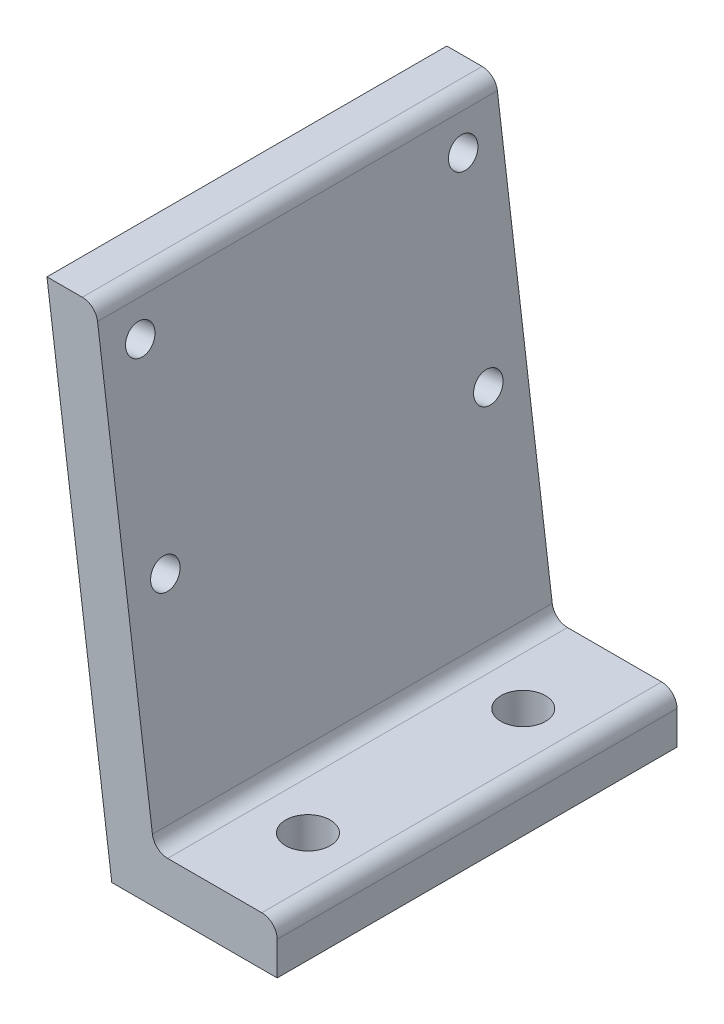
ISO-10303-21;
HEADER;
FILE_DESCRIPTION(('STEP AP214'),'2;1');
FILE_NAME('part.step','',(''),(''),'','','');
FILE_SCHEMA(('AUTOMOTIVE_DESIGN { 1 0 10303 214 1 1 1 1 }'));
ENDSEC;
DATA;
#1=APPLICATION_CONTEXT('core data for automotive mechanical design processes');
#2=APPLICATION_PROTOCOL_DEFINITION('international standard','automotive_design',2000,#1);
#3=PRODUCT_CONTEXT('',#1,'mechanical');
#4=PRODUCT('Part','Part','',(#3));
#5=PRODUCT_RELATED_PRODUCT_CATEGORY('part','',(#4));
#6=PRODUCT_DEFINITION_FORMATION('','',#4);
#7=PRODUCT_DEFINITION_CONTEXT('part definition',#1,'design');
#8=PRODUCT_DEFINITION('design','',#6,#7);
#9=PRODUCT_DEFINITION_SHAPE('','',#8);
#10=(LENGTH_UNIT() NAMED_UNIT(*) SI_UNIT(.MILLI.,.METRE.));
#11=(NAMED_UNIT(*) PLANE_ANGLE_UNIT() SI_UNIT($,.RADIAN.));
#12=(NAMED_UNIT(*) SI_UNIT($,.STERADIAN.) SOLID_ANGLE_UNIT());
#13=UNCERTAINTY_MEASURE_WITH_UNIT(LENGTH_MEASURE(1.E-05),#10,'distance_accuracy_value','');
#14=(GEOMETRIC_REPRESENTATION_CONTEXT(3) GLOBAL_UNCERTAINTY_ASSIGNED_CONTEXT((#13)) GLOBAL_UNIT_ASSIGNED_CONTEXT((#10,
#11,#12)) REPRESENTATION_CONTEXT('',''));
#15=CARTESIAN_POINT('',(0.,0.,0.));
#16=DIRECTION('',(0.,0.,1.));
#17=DIRECTION('',(1.,0.,0.));
#18=AXIS2_PLACEMENT_3D('',#15,#16,#17);
#19=CARTESIAN_POINT('',(-3.79488324295659,28.825,26.));
#20=DIRECTION('',(-0.991444861373811,-0.130526192220048,0.));
#21=DIRECTION('',(0.130526192220048,-0.991444861373811,0.));
#22=AXIS2_PLACEMENT_3D('',#19,#20,#21);
#23=PLANE('',#22);
#24=CARTESIAN_POINT('',(-1.77172726354584,13.4576046487059,23.5));
#25=DIRECTION('',(0.991444861373811,0.130526192220048,0.));
#26=DIRECTION('',(-0.130526192220048,0.991444861373811,0.));
#27=AXIS2_PLACEMENT_3D('',#24,#25,#26);
#28=CIRCLE('',#27,0.950000000000001);
#29=CARTESIAN_POINT('',(-1.89572714615489,14.3994772670111,23.5));
#30=VERTEX_POINT('',#29);
#31=EDGE_CURVE('E203',#30,#30,#28,.T.);
#32=ORIENTED_EDGE('',*,*,#31,.F.);
#33=EDGE_LOOP('',(#32));
#34=FACE_BOUND('',#33,.T.);
#35=CARTESIAN_POINT('',(-1.77172726354584,13.4576046487059,2.5));
#36=DIRECTION('',(0.991444861373811,0.130526192220048,0.));
#37=DIRECTION('',(-0.130526192220048,0.991444861373811,0.));
#38=AXIS2_PLACEMENT_3D('',#35,#36,#37);
#39=CIRCLE('',#38,0.95);
#40=CARTESIAN_POINT('',(-1.89572714615489,14.3994772670111,2.5));
#41=VERTEX_POINT('',#40);
#42=EDGE_CURVE('E202',#41,#41,#39,.T.);
#43=ORIENTED_EDGE('',*,*,#42,.F.);
#44=EDGE_LOOP('',(#43));
#45=FACE_BOUND('',#44,.T.);
#46=CARTESIAN_POINT('',(-3.40330466629645,25.8506654158786,2.50000000000001));
#47=DIRECTION('',(0.991444861373811,0.130526192220048,0.));
#48=DIRECTION('',(-0.130526192220048,0.991444861373811,0.));
#49=AXIS2_PLACEMENT_3D('',#46,#47,#48);
#50=CIRCLE('',#49,0.95);
#51=CARTESIAN_POINT('',(-3.52730454890549,26.7925380341837,2.50000000000001));
#52=VERTEX_POINT('',#51);
#53=EDGE_CURVE('E210',#52,#52,#50,.T.);
#54=ORIENTED_EDGE('',*,*,#53,.F.);
#55=EDGE_LOOP('',(#54));
#56=FACE_BOUND('',#55,.T.);
#57=CARTESIAN_POINT('',(-3.40330466629645,25.8506654158786,23.5));
#58=DIRECTION('',(0.991444861373811,0.130526192220048,0.));
#59=DIRECTION('',(-0.130526192220048,0.991444861373811,0.));
#60=AXIS2_PLACEMENT_3D('',#57,#58,#59);
#61=CIRCLE('',#60,0.950000000000001);
#62=CARTESIAN_POINT('',(-3.52730454890549,26.7925380341837,23.5));
#63=VERTEX_POINT('',#62);
#64=EDGE_CURVE('E195',#63,#63,#61,.T.);
#65=ORIENTED_EDGE('',*,*,#64,.F.);
#66=EDGE_LOOP('',(#65));
#67=FACE_BOUND('',#66,.T.);
#68=DIRECTION('',(-0.130526192220048,0.991444861373811,0.));
#69=VECTOR('',#68,1.);
#70=CARTESIAN_POINT('',(-3.79488324295659,28.825,26.));
#71=LINE('',#70,#69);
#72=CARTESIAN_POINT('',(-0.114468398381051,0.869473807779953,26.));
#73=VERTEX_POINT('',#72);
#74=CARTESIAN_POINT('',(-3.68041484457554,27.95552619222,26.));
#75=VERTEX_POINT('',#74);
#76=EDGE_CURVE('E114',#73,#75,#71,.T.);
#77=ORIENTED_EDGE('',*,*,#76,.F.);
#78=DIRECTION('',(0.,0.,-1.));
#79=VECTOR('',#78,1.);
#80=CARTESIAN_POINT('',(-0.114468398381051,0.869473807779952,0.));
#81=LINE('',#80,#79);
#82=CARTESIAN_POINT('',(-0.114468398381051,0.869473807779953,0.));
#83=VERTEX_POINT('',#82);
#84=EDGE_CURVE('E162',#73,#83,#81,.T.);
#85=ORIENTED_EDGE('',*,*,#84,.T.);
#86=DIRECTION('',(-0.130526192220048,0.991444861373811,0.));
#87=VECTOR('',#86,1.);
#88=CARTESIAN_POINT('',(-3.79488324295659,28.825,0.));
#89=LINE('',#88,#87);
#90=CARTESIAN_POINT('',(-3.68041484457554,27.95552619222,0.));
#91=VERTEX_POINT('',#90);
#92=EDGE_CURVE('E139',#83,#91,#89,.T.);
#93=ORIENTED_EDGE('',*,*,#92,.T.);
#94=DIRECTION('',(0.,0.,-1.));
#95=VECTOR('',#94,1.);
#96=CARTESIAN_POINT('',(-3.68041484457554,27.95552619222,26.));
#97=LINE('',#96,#95);
#98=EDGE_CURVE('E158',#91,#75,#97,.F.);
#99=ORIENTED_EDGE('',*,*,#98,.T.);
#100=EDGE_LOOP('',(#77,#85,#93,#99));
#101=FACE_BOUND('',#100,.T.);
#102=ADVANCED_FACE('F33',(#34,#45,#56,#67,#101),#23,.F.);
#103=CARTESIAN_POINT('',(-6.96988324295659,28.825,26.));
#104=DIRECTION('',(0.,-1.,0.));
#105=DIRECTION('',(0.,0.,-1.));
#106=AXIS2_PLACEMENT_3D('',#103,#104,#105);
#107=PLANE('',#106);
#108=DIRECTION('',(-1.,0.,0.));
#109=VECTOR('',#108,1.);
#110=CARTESIAN_POINT('',(-6.96988324295659,28.825,26.));
#111=LINE('',#110,#109);
#112=CARTESIAN_POINT('',(-4.67185970594935,28.825,26.));
#113=VERTEX_POINT('',#112);
#114=CARTESIAN_POINT('',(-6.96988324295659,28.825,26.));
#115=VERTEX_POINT('',#114);
#116=EDGE_CURVE('E103',#113,#115,#111,.T.);
#117=ORIENTED_EDGE('',*,*,#116,.F.);
#118=DIRECTION('',(0.,0.,-1.));
#119=VECTOR('',#118,1.);
#120=CARTESIAN_POINT('',(-4.67185970594935,28.825,26.));
#121=LINE('',#120,#119);
#122=CARTESIAN_POINT('',(-4.67185970594935,28.825,0.));
#123=VERTEX_POINT('',#122);
#124=EDGE_CURVE('E123',#113,#123,#121,.T.);
#125=ORIENTED_EDGE('',*,*,#124,.T.);
#126=DIRECTION('',(-1.,0.,0.));
#127=VECTOR('',#126,1.);
#128=CARTESIAN_POINT('',(-6.96988324295659,28.825,0.));
#129=LINE('',#128,#127);
#130=CARTESIAN_POINT('',(-6.96988324295659,28.825,0.));
#131=VERTEX_POINT('',#130);
#132=EDGE_CURVE('E120',#123,#131,#129,.T.);
#133=ORIENTED_EDGE('',*,*,#132,.T.);
#134=DIRECTION('',(0.,0.,-1.));
#135=VECTOR('',#134,1.);
#136=CARTESIAN_POINT('',(-6.96988324295659,28.825,26.));
#137=LINE('',#136,#135);
#138=EDGE_CURVE('E117',#115,#131,#137,.T.);
#139=ORIENTED_EDGE('',*,*,#138,.F.);
#140=EDGE_LOOP('',(#117,#125,#133,#139));
#141=FACE_BOUND('',#140,.T.);
#142=ADVANCED_FACE('F118',(#141),#107,.F.);
#143=CARTESIAN_POINT('',(-2.75700332016003,-3.175,26.));
#144=DIRECTION('',(0.991444861373811,0.130526192220048,0.));
#145=DIRECTION('',(-0.130526192220048,0.991444861373811,0.));
#146=AXIS2_PLACEMENT_3D('',#143,#144,#145);
#147=PLANE('',#146);
#148=CARTESIAN_POINT('',(-4.89263451277974,13.0467294146057,23.5));
#149=DIRECTION('',(0.991444861373811,0.130526192220048,0.));
#150=DIRECTION('',(-0.130526192220048,0.991444861373811,0.));
#151=AXIS2_PLACEMENT_3D('',#148,#149,#150);
#152=CIRCLE('',#151,0.950000000000001);
#153=CARTESIAN_POINT('',(-5.01663439538878,13.9886020329108,23.5));
#154=VERTEX_POINT('',#153);
#155=EDGE_CURVE('E199',#154,#154,#152,.F.);
#156=ORIENTED_EDGE('',*,*,#155,.F.);
#157=EDGE_LOOP('',(#156));
#158=FACE_BOUND('',#157,.T.);
#159=CARTESIAN_POINT('',(-4.89263451277974,13.0467294146057,2.5));
#160=DIRECTION('',(0.991444861373811,0.130526192220048,0.));
#161=DIRECTION('',(-0.130526192220048,0.991444861373811,0.));
#162=AXIS2_PLACEMENT_3D('',#159,#160,#161);
#163=CIRCLE('',#162,0.95);
#164=CARTESIAN_POINT('',(-5.01663439538878,13.9886020329108,2.5));
#165=VERTEX_POINT('',#164);
#166=EDGE_CURVE('E207',#165,#165,#163,.F.);
#167=ORIENTED_EDGE('',*,*,#166,.F.);
#168=EDGE_LOOP('',(#167));
#169=FACE_BOUND('',#168,.T.);
#170=CARTESIAN_POINT('',(-6.52421191553034,25.4397901817783,2.50000000000001));
#171=DIRECTION('',(0.991444861373811,0.130526192220048,0.));
#172=DIRECTION('',(-0.130526192220048,0.991444861373811,0.));
#173=AXIS2_PLACEMENT_3D('',#170,#171,#172);
#174=CIRCLE('',#173,0.95);
#175=CARTESIAN_POINT('',(-6.64821179813939,26.3816628000835,2.50000000000001));
#176=VERTEX_POINT('',#175);
#177=EDGE_CURVE('E198',#176,#176,#174,.F.);
#178=ORIENTED_EDGE('',*,*,#177,.F.);
#179=EDGE_LOOP('',(#178));
#180=FACE_BOUND('',#179,.T.);
#181=CARTESIAN_POINT('',(-6.52421191553034,25.4397901817783,23.5));
#182=DIRECTION('',(0.991444861373811,0.130526192220048,0.));
#183=DIRECTION('',(-0.130526192220048,0.991444861373811,0.));
#184=AXIS2_PLACEMENT_3D('',#181,#182,#183);
#185=CIRCLE('',#184,0.950000000000001);
#186=CARTESIAN_POINT('',(-6.64821179813939,26.3816628000835,23.5));
#187=VERTEX_POINT('',#186);
#188=EDGE_CURVE('E141',#187,#187,#185,.F.);
#189=ORIENTED_EDGE('',*,*,#188,.F.);
#190=EDGE_LOOP('',(#189));
#191=FACE_BOUND('',#190,.T.);
#192=DIRECTION('',(0.130526192220048,-0.991444861373811,0.));
#193=VECTOR('',#192,1.);
#194=CARTESIAN_POINT('',(-2.75700332016003,-3.175,0.));
#195=LINE('',#194,#193);
#196=CARTESIAN_POINT('',(-2.75700332016003,-3.175,0.));
#197=VERTEX_POINT('',#196);
#198=EDGE_CURVE('E143',#131,#197,#195,.T.);
#199=ORIENTED_EDGE('',*,*,#198,.T.);
#200=DIRECTION('',(0.,0.,-1.));
#201=VECTOR('',#200,1.);
#202=CARTESIAN_POINT('',(-2.75700332016003,-3.175,26.));
#203=LINE('',#202,#201);
#204=CARTESIAN_POINT('',(-2.75700332016003,-3.175,26.));
#205=VERTEX_POINT('',#204);
#206=EDGE_CURVE('E124',#205,#197,#203,.T.);
#207=ORIENTED_EDGE('',*,*,#206,.F.);
#208=DIRECTION('',(0.130526192220048,-0.991444861373811,0.));
#209=VECTOR('',#208,1.);
#210=CARTESIAN_POINT('',(-2.75700332016003,-3.175,26.));
#211=LINE('',#210,#209);
#212=EDGE_CURVE('E107',#115,#205,#211,.T.);
#213=ORIENTED_EDGE('',*,*,#212,.F.);
#214=ORIENTED_EDGE('',*,*,#138,.T.);
#215=EDGE_LOOP('',(#199,#207,#213,#214));
#216=FACE_BOUND('',#215,.T.);
#217=ADVANCED_FACE('F126',(#158,#169,#180,#191,#216),#147,.F.);
#218=CARTESIAN_POINT('',(8.,-3.175,26.));
#219=DIRECTION('',(0.,1.,0.));
#220=DIRECTION('',(-1.,0.,0.));
#221=AXIS2_PLACEMENT_3D('',#218,#219,#220);
#222=PLANE('',#221);
#223=CARTESIAN_POINT('',(4.,-3.175,20.));
#224=DIRECTION('',(0.,1.,0.));
#225=DIRECTION('',(-1.,0.,0.));
#226=AXIS2_PLACEMENT_3D('',#223,#224,#225);
#227=CIRCLE('',#226,1.45);
#228=CARTESIAN_POINT('',(2.55,-3.175,20.));
#229=VERTEX_POINT('',#228);
#230=EDGE_CURVE('E206',#229,#229,#227,.F.);
#231=ORIENTED_EDGE('',*,*,#230,.F.);
#232=EDGE_LOOP('',(#231));
#233=FACE_BOUND('',#232,.T.);
#234=CARTESIAN_POINT('',(4.,-3.175,6.00000000000001));
#235=DIRECTION('',(0.,1.,0.));
#236=DIRECTION('',(-1.,0.,0.));
#237=AXIS2_PLACEMENT_3D('',#234,#235,#236);
#238=CIRCLE('',#237,1.45);
#239=CARTESIAN_POINT('',(2.55,-3.175,6.00000000000001));
#240=VERTEX_POINT('',#239);
#241=EDGE_CURVE('E217',#240,#240,#238,.F.);
#242=ORIENTED_EDGE('',*,*,#241,.F.);
#243=EDGE_LOOP('',(#242));
#244=FACE_BOUND('',#243,.T.);
#245=DIRECTION('',(1.,0.,0.));
#246=VECTOR('',#245,1.);
#247=CARTESIAN_POINT('',(8.,-3.175,0.));
#248=LINE('',#247,#246);
#249=CARTESIAN_POINT('',(8.,-3.175,0.));
#250=VERTEX_POINT('',#249);
#251=EDGE_CURVE('E145',#197,#250,#248,.T.);
#252=ORIENTED_EDGE('',*,*,#251,.T.);
#253=DIRECTION('',(0.,0.,-1.));
#254=VECTOR('',#253,1.);
#255=CARTESIAN_POINT('',(8.,-3.175,26.));
#256=LINE('',#255,#254);
#257=CARTESIAN_POINT('',(8.,-3.175,26.));
#258=VERTEX_POINT('',#257);
#259=EDGE_CURVE('E138',#258,#250,#256,.T.);
#260=ORIENTED_EDGE('',*,*,#259,.F.);
#261=DIRECTION('',(1.,0.,0.));
#262=VECTOR('',#261,1.);
#263=CARTESIAN_POINT('',(8.,-3.175,26.));
#264=LINE('',#263,#262);
#265=EDGE_CURVE('E129',#205,#258,#264,.T.);
#266=ORIENTED_EDGE('',*,*,#265,.F.);
#267=ORIENTED_EDGE('',*,*,#206,.T.);
#268=EDGE_LOOP('',(#252,#260,#266,#267));
#269=FACE_BOUND('',#268,.T.);
#270=ADVANCED_FACE('F275',(#233,#244,#269),#222,.F.);
#271=CARTESIAN_POINT('',(8.,0.,26.));
#272=DIRECTION('',(-1.,0.,0.));
#273=DIRECTION('',(0.,0.,1.));
#274=AXIS2_PLACEMENT_3D('',#271,#272,#273);
#275=PLANE('',#274);
#276=DIRECTION('',(0.,1.,0.));
#277=VECTOR('',#276,1.);
#278=CARTESIAN_POINT('',(8.,0.,0.));
#279=LINE('',#278,#277);
#280=CARTESIAN_POINT('',(8.,-1.,0.));
#281=VERTEX_POINT('',#280);
#282=EDGE_CURVE('E147',#250,#281,#279,.T.);
#283=ORIENTED_EDGE('',*,*,#282,.T.);
#284=DIRECTION('',(0.,0.,-1.));
#285=VECTOR('',#284,1.);
#286=CARTESIAN_POINT('',(8.,-1.,26.));
#287=LINE('',#286,#285);
#288=CARTESIAN_POINT('',(8.,-1.,26.));
#289=VERTEX_POINT('',#288);
#290=EDGE_CURVE('E41',#281,#289,#287,.F.);
#291=ORIENTED_EDGE('',*,*,#290,.T.);
#292=DIRECTION('',(0.,1.,0.));
#293=VECTOR('',#292,1.);
#294=CARTESIAN_POINT('',(8.,0.,26.));
#295=LINE('',#294,#293);
#296=EDGE_CURVE('E131',#258,#289,#295,.T.);
#297=ORIENTED_EDGE('',*,*,#296,.F.);
#298=ORIENTED_EDGE('',*,*,#259,.T.);
#299=EDGE_LOOP('',(#283,#291,#297,#298));
#300=FACE_BOUND('',#299,.T.);
#301=ADVANCED_FACE('F233',(#300),#275,.F.);
#302=CARTESIAN_POINT('',(0.,0.,26.));
#303=DIRECTION('',(0.,-1.,0.));
#304=DIRECTION('',(0.,0.,-1.));
#305=AXIS2_PLACEMENT_3D('',#302,#303,#304);
#306=PLANE('',#305);
#307=CARTESIAN_POINT('',(4.,0.,20.));
#308=DIRECTION('',(0.,1.,0.));
#309=DIRECTION('',(0.,0.,1.));
#310=AXIS2_PLACEMENT_3D('',#307,#308,#309);
#311=CIRCLE('',#310,1.45);
#312=CARTESIAN_POINT('',(4.,0.,21.45));
#313=VERTEX_POINT('',#312);
#314=EDGE_CURVE('E220',#313,#313,#311,.T.);
#315=ORIENTED_EDGE('',*,*,#314,.F.);
#316=EDGE_LOOP('',(#315));
#317=FACE_BOUND('',#316,.T.);
#318=CARTESIAN_POINT('',(4.,0.,6.00000000000001));
#319=DIRECTION('',(0.,1.,0.));
#320=DIRECTION('',(0.,0.,-1.));
#321=AXIS2_PLACEMENT_3D('',#318,#319,#320);
#322=CIRCLE('',#321,1.45);
#323=CARTESIAN_POINT('',(4.,0.,4.55000000000001));
#324=VERTEX_POINT('',#323);
#325=EDGE_CURVE('E221',#324,#324,#322,.T.);
#326=ORIENTED_EDGE('',*,*,#325,.F.);
#327=EDGE_LOOP('',(#326));
#328=FACE_BOUND('',#327,.T.);
#329=DIRECTION('',(-1.,0.,0.));
#330=VECTOR('',#329,1.);
#331=CARTESIAN_POINT('',(0.,0.,26.));
#332=LINE('',#331,#330);
#333=CARTESIAN_POINT('',(7.,0.,26.));
#334=VERTEX_POINT('',#333);
#335=CARTESIAN_POINT('',(0.87697646299276,0.,26.));
#336=VERTEX_POINT('',#335);
#337=EDGE_CURVE('E136',#334,#336,#332,.T.);
#338=ORIENTED_EDGE('',*,*,#337,.F.);
#339=DIRECTION('',(0.,0.,-1.));
#340=VECTOR('',#339,1.);
#341=CARTESIAN_POINT('',(7.,0.,26.));
#342=LINE('',#341,#340);
#343=CARTESIAN_POINT('',(7.,0.,0.));
#344=VERTEX_POINT('',#343);
#345=EDGE_CURVE('E173',#334,#344,#342,.T.);
#346=ORIENTED_EDGE('',*,*,#345,.T.);
#347=DIRECTION('',(-1.,0.,0.));
#348=VECTOR('',#347,1.);
#349=CARTESIAN_POINT('',(0.,0.,0.));
#350=LINE('',#349,#348);
#351=CARTESIAN_POINT('',(0.87697646299276,0.,0.));
#352=VERTEX_POINT('',#351);
#353=EDGE_CURVE('E149',#344,#352,#350,.T.);
#354=ORIENTED_EDGE('',*,*,#353,.T.);
#355=DIRECTION('',(0.,0.,-1.));
#356=VECTOR('',#355,1.);
#357=CARTESIAN_POINT('',(0.87697646299276,0.,26.));
#358=LINE('',#357,#356);
#359=EDGE_CURVE('E165',#352,#336,#358,.F.);
#360=ORIENTED_EDGE('',*,*,#359,.T.);
#361=EDGE_LOOP('',(#338,#346,#354,#360));
#362=FACE_BOUND('',#361,.T.);
#363=ADVANCED_FACE('F179',(#317,#328,#362),#306,.F.);
#364=CARTESIAN_POINT('',(0.,0.,26.));
#365=DIRECTION('',(0.,0.,1.));
#366=DIRECTION('',(1.,0.,0.));
#367=AXIS2_PLACEMENT_3D('',#364,#365,#366);
#368=PLANE('',#367);
#369=ORIENTED_EDGE('',*,*,#296,.T.);
#370=CARTESIAN_POINT('',(7.,-1.,26.));
#371=DIRECTION('',(0.,0.,1.));
#372=DIRECTION('',(1.,0.,0.));
#373=AXIS2_PLACEMENT_3D('',#370,#371,#372);
#374=CIRCLE('',#373,1.);
#375=EDGE_CURVE('E11',#289,#334,#374,.T.);
#376=ORIENTED_EDGE('',*,*,#375,.T.);
#377=ORIENTED_EDGE('',*,*,#337,.T.);
#378=CARTESIAN_POINT('',(0.87697646299276,1.,26.));
#379=DIRECTION('',(0.,0.,1.));
#380=DIRECTION('',(1.,0.,0.));
#381=AXIS2_PLACEMENT_3D('',#378,#379,#380);
#382=CIRCLE('',#381,1.);
#383=EDGE_CURVE('E171',#336,#73,#382,.F.);
#384=ORIENTED_EDGE('',*,*,#383,.T.);
#385=ORIENTED_EDGE('',*,*,#76,.T.);
#386=CARTESIAN_POINT('',(-4.67185970594935,27.825,26.));
#387=DIRECTION('',(0.,0.,1.));
#388=DIRECTION('',(1.,0.,0.));
#389=AXIS2_PLACEMENT_3D('',#386,#387,#388);
#390=CIRCLE('',#389,1.);
#391=EDGE_CURVE('E110',#75,#113,#390,.T.);
#392=ORIENTED_EDGE('',*,*,#391,.T.);
#393=ORIENTED_EDGE('',*,*,#116,.T.);
#394=ORIENTED_EDGE('',*,*,#212,.T.);
#395=ORIENTED_EDGE('',*,*,#265,.T.);
#396=EDGE_LOOP('',(#369,#376,#377,#384,#385,#392,#393,#394,#395));
#397=FACE_BOUND('',#396,.T.);
#398=ADVANCED_FACE('F105',(#397),#368,.T.);
#399=CARTESIAN_POINT('',(0.,0.,0.));
#400=DIRECTION('',(0.,0.,1.));
#401=DIRECTION('',(1.,0.,0.));
#402=AXIS2_PLACEMENT_3D('',#399,#400,#401);
#403=PLANE('',#402);
#404=ORIENTED_EDGE('',*,*,#353,.F.);
#405=CARTESIAN_POINT('',(7.,-1.,0.));
#406=DIRECTION('',(0.,0.,1.));
#407=DIRECTION('',(1.,0.,0.));
#408=AXIS2_PLACEMENT_3D('',#405,#406,#407);
#409=CIRCLE('',#408,1.);
#410=EDGE_CURVE('E55',#344,#281,#409,.F.);
#411=ORIENTED_EDGE('',*,*,#410,.T.);
#412=ORIENTED_EDGE('',*,*,#282,.F.);
#413=ORIENTED_EDGE('',*,*,#251,.F.);
#414=ORIENTED_EDGE('',*,*,#198,.F.);
#415=ORIENTED_EDGE('',*,*,#132,.F.);
#416=CARTESIAN_POINT('',(-4.67185970594935,27.825,0.));
#417=DIRECTION('',(0.,0.,1.));
#418=DIRECTION('',(1.,0.,0.));
#419=AXIS2_PLACEMENT_3D('',#416,#417,#418);
#420=CIRCLE('',#419,1.);
#421=EDGE_CURVE('E155',#123,#91,#420,.F.);
#422=ORIENTED_EDGE('',*,*,#421,.T.);
#423=ORIENTED_EDGE('',*,*,#92,.F.);
#424=CARTESIAN_POINT('',(0.87697646299276,1.,0.));
#425=DIRECTION('',(0.,0.,1.));
#426=DIRECTION('',(1.,0.,0.));
#427=AXIS2_PLACEMENT_3D('',#424,#425,#426);
#428=CIRCLE('',#427,1.);
#429=EDGE_CURVE('E168',#83,#352,#428,.T.);
#430=ORIENTED_EDGE('',*,*,#429,.T.);
#431=EDGE_LOOP('',(#404,#411,#412,#413,#414,#415,#422,#423,#430));
#432=FACE_BOUND('',#431,.T.);
#433=ADVANCED_FACE('F182',(#432),#403,.F.);
#434=CARTESIAN_POINT('',(-9.18822997720026,25.0890655503416,23.5));
#435=DIRECTION('',(0.991444861373811,0.130526192220048,0.));
#436=DIRECTION('',(-0.130526192220048,0.991444861373811,0.));
#437=AXIS2_PLACEMENT_3D('',#434,#435,#436);
#438=CYLINDRICAL_SURFACE('',#437,0.950000000000001);
#439=ORIENTED_EDGE('',*,*,#188,.T.);
#440=EDGE_LOOP('',(#439));
#441=FACE_BOUND('',#440,.T.);
#442=ORIENTED_EDGE('',*,*,#64,.T.);
#443=EDGE_LOOP('',(#442));
#444=FACE_BOUND('',#443,.T.);
#445=ADVANCED_FACE('F290',(#441,#444),#438,.F.);
#446=CARTESIAN_POINT('',(-9.18822997720026,25.0890655503416,2.50000000000001));
#447=DIRECTION('',(0.991444861373811,0.130526192220048,0.));
#448=DIRECTION('',(-0.130526192220048,0.991444861373811,0.));
#449=AXIS2_PLACEMENT_3D('',#446,#447,#448);
#450=CYLINDRICAL_SURFACE('',#449,0.95);
#451=ORIENTED_EDGE('',*,*,#177,.T.);
#452=EDGE_LOOP('',(#451));
#453=FACE_BOUND('',#452,.T.);
#454=ORIENTED_EDGE('',*,*,#53,.T.);
#455=EDGE_LOOP('',(#454));
#456=FACE_BOUND('',#455,.T.);
#457=ADVANCED_FACE('F294',(#453,#456),#450,.F.);
#458=CARTESIAN_POINT('',(-7.55665257444966,12.6960047831689,2.5));
#459=DIRECTION('',(0.991444861373811,0.130526192220048,0.));
#460=DIRECTION('',(-0.130526192220048,0.991444861373811,0.));
#461=AXIS2_PLACEMENT_3D('',#458,#459,#460);
#462=CYLINDRICAL_SURFACE('',#461,0.95);
#463=ORIENTED_EDGE('',*,*,#166,.T.);
#464=EDGE_LOOP('',(#463));
#465=FACE_BOUND('',#464,.T.);
#466=ORIENTED_EDGE('',*,*,#42,.T.);
#467=EDGE_LOOP('',(#466));
#468=FACE_BOUND('',#467,.T.);
#469=ADVANCED_FACE('F249',(#465,#468),#462,.F.);
#470=CARTESIAN_POINT('',(-7.55665257444966,12.6960047831689,23.5));
#471=DIRECTION('',(0.991444861373811,0.130526192220048,0.));
#472=DIRECTION('',(-0.130526192220048,0.991444861373811,0.));
#473=AXIS2_PLACEMENT_3D('',#470,#471,#472);
#474=CYLINDRICAL_SURFACE('',#473,0.950000000000001);
#475=ORIENTED_EDGE('',*,*,#155,.T.);
#476=EDGE_LOOP('',(#475));
#477=FACE_BOUND('',#476,.T.);
#478=ORIENTED_EDGE('',*,*,#31,.T.);
#479=EDGE_LOOP('',(#478));
#480=FACE_BOUND('',#479,.T.);
#481=ADVANCED_FACE('F239',(#477,#480),#474,.F.);
#482=CARTESIAN_POINT('',(4.,-7.27621933088198,6.00000000000001));
#483=DIRECTION('',(0.,1.,0.));
#484=DIRECTION('',(0.,0.,1.));
#485=AXIS2_PLACEMENT_3D('',#482,#483,#484);
#486=CYLINDRICAL_SURFACE('',#485,1.45);
#487=ORIENTED_EDGE('',*,*,#241,.T.);
#488=EDGE_LOOP('',(#487));
#489=FACE_BOUND('',#488,.T.);
#490=ORIENTED_EDGE('',*,*,#325,.T.);
#491=EDGE_LOOP('',(#490));
#492=FACE_BOUND('',#491,.T.);
#493=ADVANCED_FACE('F237',(#489,#492),#486,.F.);
#494=CARTESIAN_POINT('',(4.,-7.27621933088198,20.));
#495=DIRECTION('',(0.,1.,0.));
#496=DIRECTION('',(0.,0.,1.));
#497=AXIS2_PLACEMENT_3D('',#494,#495,#496);
#498=CYLINDRICAL_SURFACE('',#497,1.45);
#499=ORIENTED_EDGE('',*,*,#230,.T.);
#500=EDGE_LOOP('',(#499));
#501=FACE_BOUND('',#500,.T.);
#502=ORIENTED_EDGE('',*,*,#314,.T.);
#503=EDGE_LOOP('',(#502));
#504=FACE_BOUND('',#503,.T.);
#505=ADVANCED_FACE('F229',(#501,#504),#498,.F.);
#506=CARTESIAN_POINT('',(-4.67185970594935,27.825,26.));
#507=DIRECTION('',(0.,0.,-1.));
#508=DIRECTION('',(-1.,0.,0.));
#509=AXIS2_PLACEMENT_3D('',#506,#507,#508);
#510=CYLINDRICAL_SURFACE('',#509,1.);
#511=ORIENTED_EDGE('',*,*,#391,.F.);
#512=ORIENTED_EDGE('',*,*,#98,.F.);
#513=ORIENTED_EDGE('',*,*,#421,.F.);
#514=ORIENTED_EDGE('',*,*,#124,.F.);
#515=EDGE_LOOP('',(#511,#512,#513,#514));
#516=FACE_BOUND('',#515,.T.);
#517=ADVANCED_FACE('F246',(#516),#510,.T.);
#518=CARTESIAN_POINT('',(0.87697646299276,1.,26.));
#519=DIRECTION('',(0.,0.,1.));
#520=DIRECTION('',(1.,0.,0.));
#521=AXIS2_PLACEMENT_3D('',#518,#519,#520);
#522=CYLINDRICAL_SURFACE('',#521,1.);
#523=ORIENTED_EDGE('',*,*,#383,.F.);
#524=ORIENTED_EDGE('',*,*,#359,.F.);
#525=ORIENTED_EDGE('',*,*,#429,.F.);
#526=ORIENTED_EDGE('',*,*,#84,.F.);
#527=EDGE_LOOP('',(#523,#524,#525,#526));
#528=FACE_BOUND('',#527,.T.);
#529=ADVANCED_FACE('F188',(#528),#522,.F.);
#530=CARTESIAN_POINT('',(7.,-1.,26.));
#531=DIRECTION('',(0.,0.,-1.));
#532=DIRECTION('',(-1.,0.,0.));
#533=AXIS2_PLACEMENT_3D('',#530,#531,#532);
#534=CYLINDRICAL_SURFACE('',#533,1.);
#535=ORIENTED_EDGE('',*,*,#375,.F.);
#536=ORIENTED_EDGE('',*,*,#290,.F.);
#537=ORIENTED_EDGE('',*,*,#410,.F.);
#538=ORIENTED_EDGE('',*,*,#345,.F.);
#539=EDGE_LOOP('',(#535,#536,#537,#538));
#540=FACE_BOUND('',#539,.T.);
#541=ADVANCED_FACE('F35',(#540),#534,.T.);
#542=CLOSED_SHELL('',(#102,#142,#217,#270,#301,#363,#398,#433,#445,#457,#469,#481,#493,#505,
#517,#529,#541));
#543=MANIFOLD_SOLID_BREP('B2',#542);
#544=ADVANCED_BREP_SHAPE_REPRESENTATION('',(#18,#543),#14);
#545=SHAPE_DEFINITION_REPRESENTATION(#9,#544);
ENDSEC;
END-ISO-10303-21;
